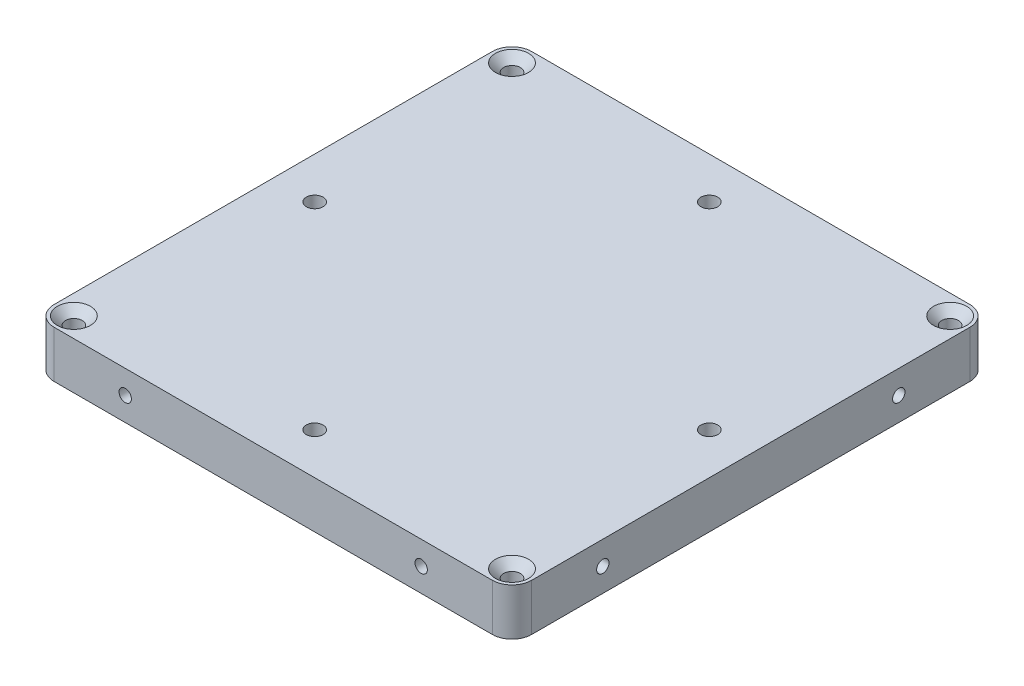
ISO-10303-21;
HEADER;
FILE_DESCRIPTION(('STEP AP214'),'2;1');
FILE_NAME('part.step','',(''),(''),'','','');
FILE_SCHEMA(('AUTOMOTIVE_DESIGN { 1 0 10303 214 1 1 1 1 }'));
ENDSEC;
DATA;
#1=APPLICATION_CONTEXT('core data for automotive mechanical design processes');
#2=APPLICATION_PROTOCOL_DEFINITION('international standard','automotive_design',2000,#1);
#3=PRODUCT_CONTEXT('',#1,'mechanical');
#4=PRODUCT('Part','Part','',(#3));
#5=PRODUCT_RELATED_PRODUCT_CATEGORY('part','',(#4));
#6=PRODUCT_DEFINITION_FORMATION('','',#4);
#7=PRODUCT_DEFINITION_CONTEXT('part definition',#1,'design');
#8=PRODUCT_DEFINITION('design','',#6,#7);
#9=PRODUCT_DEFINITION_SHAPE('','',#8);
#10=(LENGTH_UNIT() NAMED_UNIT(*) SI_UNIT(.MILLI.,.METRE.));
#11=(NAMED_UNIT(*) PLANE_ANGLE_UNIT() SI_UNIT($,.RADIAN.));
#12=(NAMED_UNIT(*) SI_UNIT($,.STERADIAN.) SOLID_ANGLE_UNIT());
#13=UNCERTAINTY_MEASURE_WITH_UNIT(LENGTH_MEASURE(1.E-05),#10,'distance_accuracy_value','');
#14=(GEOMETRIC_REPRESENTATION_CONTEXT(3) GLOBAL_UNCERTAINTY_ASSIGNED_CONTEXT((#13)) GLOBAL_UNIT_ASSIGNED_CONTEXT((#10,
#11,#12)) REPRESENTATION_CONTEXT('',''));
#15=CARTESIAN_POINT('',(0.,0.,0.));
#16=DIRECTION('',(0.,0.,1.));
#17=DIRECTION('',(1.,0.,0.));
#18=AXIS2_PLACEMENT_3D('',#15,#16,#17);
#19=CARTESIAN_POINT('',(-48.4125,4.7625,48.4125));
#20=DIRECTION('',(1.,0.,0.));
#21=DIRECTION('',(0.,0.,-1.));
#22=AXIS2_PLACEMENT_3D('',#19,#20,#21);
#23=PLANE('',#22);
#24=CARTESIAN_POINT('',(-48.4125,0.,-30.));
#25=DIRECTION('',(-1.,0.,0.));
#26=DIRECTION('',(0.,0.,1.));
#27=AXIS2_PLACEMENT_3D('',#24,#25,#26);
#28=CIRCLE('',#27,1.24999999999999);
#29=CARTESIAN_POINT('',(-48.4125,0.,-28.75));
#30=VERTEX_POINT('',#29);
#31=EDGE_CURVE('E164',#30,#30,#28,.T.);
#32=ORIENTED_EDGE('',*,*,#31,.F.);
#33=EDGE_LOOP('',(#32));
#34=FACE_BOUND('',#33,.T.);
#35=CARTESIAN_POINT('',(-48.4125,0.,30.));
#36=DIRECTION('',(-1.,0.,0.));
#37=DIRECTION('',(0.,0.,1.));
#38=AXIS2_PLACEMENT_3D('',#35,#36,#37);
#39=CIRCLE('',#38,1.24999999999999);
#40=CARTESIAN_POINT('',(-48.4125,0.,31.25));
#41=VERTEX_POINT('',#40);
#42=EDGE_CURVE('E170',#41,#41,#39,.T.);
#43=ORIENTED_EDGE('',*,*,#42,.F.);
#44=EDGE_LOOP('',(#43));
#45=FACE_BOUND('',#44,.T.);
#46=DIRECTION('',(0.,0.,1.));
#47=VECTOR('',#46,1.);
#48=CARTESIAN_POINT('',(-48.4125,4.7625,48.4125));
#49=LINE('',#48,#47);
#50=CARTESIAN_POINT('',(-48.4125,4.7625,-44.4125));
#51=VERTEX_POINT('',#50);
#52=CARTESIAN_POINT('',(-48.4125,4.7625,44.4125));
#53=VERTEX_POINT('',#52);
#54=EDGE_CURVE('E252',#51,#53,#49,.T.);
#55=ORIENTED_EDGE('',*,*,#54,.F.);
#56=DIRECTION('',(0.,-1.,0.));
#57=VECTOR('',#56,1.);
#58=CARTESIAN_POINT('',(-48.4125,4.7625,-44.4125));
#59=LINE('',#58,#57);
#60=CARTESIAN_POINT('',(-48.4125,-4.7625,-44.4125));
#61=VERTEX_POINT('',#60);
#62=EDGE_CURVE('E274',#51,#61,#59,.T.);
#63=ORIENTED_EDGE('',*,*,#62,.T.);
#64=DIRECTION('',(0.,0.,1.));
#65=VECTOR('',#64,1.);
#66=CARTESIAN_POINT('',(-48.4125,-4.7625,48.4125));
#67=LINE('',#66,#65);
#68=CARTESIAN_POINT('',(-48.4125,-4.7625,44.4125));
#69=VERTEX_POINT('',#68);
#70=EDGE_CURVE('E251',#61,#69,#67,.T.);
#71=ORIENTED_EDGE('',*,*,#70,.T.);
#72=DIRECTION('',(0.,-1.,0.));
#73=VECTOR('',#72,1.);
#74=CARTESIAN_POINT('',(-48.4125,4.7625,44.4125));
#75=LINE('',#74,#73);
#76=EDGE_CURVE('E263',#69,#53,#75,.F.);
#77=ORIENTED_EDGE('',*,*,#76,.T.);
#78=EDGE_LOOP('',(#55,#63,#71,#77));
#79=FACE_BOUND('',#78,.T.);
#80=ADVANCED_FACE('F41',(#34,#45,#79),#23,.F.);
#81=CARTESIAN_POINT('',(48.4125,4.7625,48.4125));
#82=DIRECTION('',(0.,0.,-1.));
#83=DIRECTION('',(-1.,0.,0.));
#84=AXIS2_PLACEMENT_3D('',#81,#82,#83);
#85=PLANE('',#84);
#86=CARTESIAN_POINT('',(-30.,0.,48.4125));
#87=DIRECTION('',(0.,0.,1.));
#88=DIRECTION('',(1.,0.,0.));
#89=AXIS2_PLACEMENT_3D('',#86,#87,#88);
#90=CIRCLE('',#89,1.24999999999999);
#91=CARTESIAN_POINT('',(-28.75,0.,48.4125));
#92=VERTEX_POINT('',#91);
#93=EDGE_CURVE('E176',#92,#92,#90,.T.);
#94=ORIENTED_EDGE('',*,*,#93,.F.);
#95=EDGE_LOOP('',(#94));
#96=FACE_BOUND('',#95,.T.);
#97=CARTESIAN_POINT('',(30.,0.,48.4125));
#98=DIRECTION('',(0.,0.,1.));
#99=DIRECTION('',(1.,0.,0.));
#100=AXIS2_PLACEMENT_3D('',#97,#98,#99);
#101=CIRCLE('',#100,1.24999999999999);
#102=CARTESIAN_POINT('',(31.25,0.,48.4125));
#103=VERTEX_POINT('',#102);
#104=EDGE_CURVE('E182',#103,#103,#101,.T.);
#105=ORIENTED_EDGE('',*,*,#104,.F.);
#106=EDGE_LOOP('',(#105));
#107=FACE_BOUND('',#106,.T.);
#108=DIRECTION('',(1.,0.,0.));
#109=VECTOR('',#108,1.);
#110=CARTESIAN_POINT('',(48.4125,-4.7625,48.4125));
#111=LINE('',#110,#109);
#112=CARTESIAN_POINT('',(-44.4125,-4.7625,48.4125));
#113=VERTEX_POINT('',#112);
#114=CARTESIAN_POINT('',(44.4125,-4.7625,48.4125));
#115=VERTEX_POINT('',#114);
#116=EDGE_CURVE('E266',#113,#115,#111,.T.);
#117=ORIENTED_EDGE('',*,*,#116,.T.);
#118=DIRECTION('',(0.,-1.,0.));
#119=VECTOR('',#118,1.);
#120=CARTESIAN_POINT('',(44.4125,4.7625,48.4125));
#121=LINE('',#120,#119);
#122=CARTESIAN_POINT('',(44.4125,4.7625,48.4125));
#123=VERTEX_POINT('',#122);
#124=EDGE_CURVE('E11',#115,#123,#121,.F.);
#125=ORIENTED_EDGE('',*,*,#124,.T.);
#126=DIRECTION('',(1.,0.,0.));
#127=VECTOR('',#126,1.);
#128=CARTESIAN_POINT('',(48.4125,4.7625,48.4125));
#129=LINE('',#128,#127);
#130=CARTESIAN_POINT('',(-44.4125,4.7625,48.4125));
#131=VERTEX_POINT('',#130);
#132=EDGE_CURVE('E255',#131,#123,#129,.T.);
#133=ORIENTED_EDGE('',*,*,#132,.F.);
#134=DIRECTION('',(0.,-1.,0.));
#135=VECTOR('',#134,1.);
#136=CARTESIAN_POINT('',(-44.4125,4.7625,48.4125));
#137=LINE('',#136,#135);
#138=EDGE_CURVE('E50',#131,#113,#137,.T.);
#139=ORIENTED_EDGE('',*,*,#138,.T.);
#140=EDGE_LOOP('',(#117,#125,#133,#139));
#141=FACE_BOUND('',#140,.T.);
#142=ADVANCED_FACE('F329',(#96,#107,#141),#85,.F.);
#143=CARTESIAN_POINT('',(48.4125,4.7625,48.4125));
#144=DIRECTION('',(-1.,0.,0.));
#145=DIRECTION('',(0.,0.,1.));
#146=AXIS2_PLACEMENT_3D('',#143,#144,#145);
#147=PLANE('',#146);
#148=CARTESIAN_POINT('',(48.4125,0.,30.));
#149=DIRECTION('',(1.,0.,0.));
#150=DIRECTION('',(0.,0.,-1.));
#151=AXIS2_PLACEMENT_3D('',#148,#149,#150);
#152=CIRCLE('',#151,1.24999999999999);
#153=CARTESIAN_POINT('',(48.4125,0.,28.75));
#154=VERTEX_POINT('',#153);
#155=EDGE_CURVE('E142',#154,#154,#152,.T.);
#156=ORIENTED_EDGE('',*,*,#155,.F.);
#157=EDGE_LOOP('',(#156));
#158=FACE_BOUND('',#157,.T.);
#159=CARTESIAN_POINT('',(48.4125,0.,-30.));
#160=DIRECTION('',(1.,0.,0.));
#161=DIRECTION('',(0.,0.,-1.));
#162=AXIS2_PLACEMENT_3D('',#159,#160,#161);
#163=CIRCLE('',#162,1.24999999999999);
#164=CARTESIAN_POINT('',(48.4125,0.,-31.25));
#165=VERTEX_POINT('',#164);
#166=EDGE_CURVE('E141',#165,#165,#163,.T.);
#167=ORIENTED_EDGE('',*,*,#166,.F.);
#168=EDGE_LOOP('',(#167));
#169=FACE_BOUND('',#168,.T.);
#170=DIRECTION('',(0.,0.,-1.));
#171=VECTOR('',#170,1.);
#172=CARTESIAN_POINT('',(48.4125,-4.7625,48.4125));
#173=LINE('',#172,#171);
#174=CARTESIAN_POINT('',(48.4125,-4.7625,44.4125));
#175=VERTEX_POINT('',#174);
#176=CARTESIAN_POINT('',(48.4125,-4.7625,-44.4125));
#177=VERTEX_POINT('',#176);
#178=EDGE_CURVE('E269',#175,#177,#173,.T.);
#179=ORIENTED_EDGE('',*,*,#178,.T.);
#180=DIRECTION('',(0.,-1.,0.));
#181=VECTOR('',#180,1.);
#182=CARTESIAN_POINT('',(48.4125,4.7625,-44.4125));
#183=LINE('',#182,#181);
#184=CARTESIAN_POINT('',(48.4125,4.7625,-44.4125));
#185=VERTEX_POINT('',#184);
#186=EDGE_CURVE('E58',#177,#185,#183,.F.);
#187=ORIENTED_EDGE('',*,*,#186,.T.);
#188=DIRECTION('',(0.,0.,-1.));
#189=VECTOR('',#188,1.);
#190=CARTESIAN_POINT('',(48.4125,4.7625,48.4125));
#191=LINE('',#190,#189);
#192=CARTESIAN_POINT('',(48.4125,4.7625,44.4125));
#193=VERTEX_POINT('',#192);
#194=EDGE_CURVE('E258',#193,#185,#191,.T.);
#195=ORIENTED_EDGE('',*,*,#194,.F.);
#196=DIRECTION('',(0.,-1.,0.));
#197=VECTOR('',#196,1.);
#198=CARTESIAN_POINT('',(48.4125,4.7625,44.4125));
#199=LINE('',#198,#197);
#200=EDGE_CURVE('E297',#193,#175,#199,.T.);
#201=ORIENTED_EDGE('',*,*,#200,.T.);
#202=EDGE_LOOP('',(#179,#187,#195,#201));
#203=FACE_BOUND('',#202,.T.);
#204=ADVANCED_FACE('F337',(#158,#169,#203),#147,.F.);
#205=CARTESIAN_POINT('',(48.4125,4.7625,-48.4125));
#206=DIRECTION('',(0.,0.,1.));
#207=DIRECTION('',(1.,0.,0.));
#208=AXIS2_PLACEMENT_3D('',#205,#206,#207);
#209=PLANE('',#208);
#210=CARTESIAN_POINT('',(30.,0.,-48.4125));
#211=DIRECTION('',(0.,0.,-1.));
#212=DIRECTION('',(-1.,0.,0.));
#213=AXIS2_PLACEMENT_3D('',#210,#211,#212);
#214=CIRCLE('',#213,1.24999999999999);
#215=CARTESIAN_POINT('',(28.75,0.,-48.4125));
#216=VERTEX_POINT('',#215);
#217=EDGE_CURVE('E152',#216,#216,#214,.T.);
#218=ORIENTED_EDGE('',*,*,#217,.F.);
#219=EDGE_LOOP('',(#218));
#220=FACE_BOUND('',#219,.T.);
#221=CARTESIAN_POINT('',(-30.,0.,-48.4125));
#222=DIRECTION('',(0.,0.,-1.));
#223=DIRECTION('',(-1.,0.,0.));
#224=AXIS2_PLACEMENT_3D('',#221,#222,#223);
#225=CIRCLE('',#224,1.24999999999999);
#226=CARTESIAN_POINT('',(-31.25,0.,-48.4125));
#227=VERTEX_POINT('',#226);
#228=EDGE_CURVE('E158',#227,#227,#225,.T.);
#229=ORIENTED_EDGE('',*,*,#228,.F.);
#230=EDGE_LOOP('',(#229));
#231=FACE_BOUND('',#230,.T.);
#232=DIRECTION('',(-1.,0.,0.));
#233=VECTOR('',#232,1.);
#234=CARTESIAN_POINT('',(48.4125,-4.7625,-48.4125));
#235=LINE('',#234,#233);
#236=CARTESIAN_POINT('',(44.4125,-4.7625,-48.4125));
#237=VERTEX_POINT('',#236);
#238=CARTESIAN_POINT('',(-44.4125,-4.7625,-48.4125));
#239=VERTEX_POINT('',#238);
#240=EDGE_CURVE('E256',#237,#239,#235,.T.);
#241=ORIENTED_EDGE('',*,*,#240,.T.);
#242=DIRECTION('',(0.,-1.,0.));
#243=VECTOR('',#242,1.);
#244=CARTESIAN_POINT('',(-44.4125,4.7625,-48.4125));
#245=LINE('',#244,#243);
#246=CARTESIAN_POINT('',(-44.4125,4.7625,-48.4125));
#247=VERTEX_POINT('',#246);
#248=EDGE_CURVE('E288',#239,#247,#245,.F.);
#249=ORIENTED_EDGE('',*,*,#248,.T.);
#250=DIRECTION('',(-1.,0.,0.));
#251=VECTOR('',#250,1.);
#252=CARTESIAN_POINT('',(48.4125,4.7625,-48.4125));
#253=LINE('',#252,#251);
#254=CARTESIAN_POINT('',(44.4125,4.7625,-48.4125));
#255=VERTEX_POINT('',#254);
#256=EDGE_CURVE('E260',#255,#247,#253,.T.);
#257=ORIENTED_EDGE('',*,*,#256,.F.);
#258=DIRECTION('',(0.,-1.,0.));
#259=VECTOR('',#258,1.);
#260=CARTESIAN_POINT('',(44.4125,4.7625,-48.4125));
#261=LINE('',#260,#259);
#262=EDGE_CURVE('E285',#255,#237,#261,.T.);
#263=ORIENTED_EDGE('',*,*,#262,.T.);
#264=EDGE_LOOP('',(#241,#249,#257,#263));
#265=FACE_BOUND('',#264,.T.);
#266=ADVANCED_FACE('F370',(#220,#231,#265),#209,.F.);
#267=CARTESIAN_POINT('',(0.,4.7625,0.));
#268=DIRECTION('',(0.,1.,0.));
#269=DIRECTION('',(0.,0.,1.));
#270=AXIS2_PLACEMENT_3D('',#267,#268,#269);
#271=PLANE('',#270);
#272=CARTESIAN_POINT('',(-44.4125,4.7625,-44.4125));
#273=DIRECTION('',(0.,1.,0.));
#274=DIRECTION('',(0.,0.,1.));
#275=AXIS2_PLACEMENT_3D('',#272,#273,#274);
#276=CIRCLE('',#275,3.36);
#277=CARTESIAN_POINT('',(-44.4125,4.7625,-41.0525));
#278=VERTEX_POINT('',#277);
#279=EDGE_CURVE('E188',#278,#278,#276,.T.);
#280=ORIENTED_EDGE('',*,*,#279,.F.);
#281=EDGE_LOOP('',(#280));
#282=FACE_BOUND('',#281,.T.);
#283=CARTESIAN_POINT('',(44.4125,4.7625,-44.4125));
#284=DIRECTION('',(0.,1.,0.));
#285=DIRECTION('',(0.,0.,1.));
#286=AXIS2_PLACEMENT_3D('',#283,#284,#285);
#287=CIRCLE('',#286,3.36);
#288=CARTESIAN_POINT('',(44.4125,4.7625,-41.0525));
#289=VERTEX_POINT('',#288);
#290=EDGE_CURVE('E194',#289,#289,#287,.T.);
#291=ORIENTED_EDGE('',*,*,#290,.F.);
#292=EDGE_LOOP('',(#291));
#293=FACE_BOUND('',#292,.T.);
#294=CARTESIAN_POINT('',(44.4125,4.7625,44.4125));
#295=DIRECTION('',(0.,1.,0.));
#296=DIRECTION('',(0.,0.,1.));
#297=AXIS2_PLACEMENT_3D('',#294,#295,#296);
#298=CIRCLE('',#297,3.36);
#299=CARTESIAN_POINT('',(44.4125,4.7625,47.7725));
#300=VERTEX_POINT('',#299);
#301=EDGE_CURVE('E201',#300,#300,#298,.T.);
#302=ORIENTED_EDGE('',*,*,#301,.F.);
#303=EDGE_LOOP('',(#302));
#304=FACE_BOUND('',#303,.T.);
#305=CARTESIAN_POINT('',(-44.4125,4.7625,44.4125));
#306=DIRECTION('',(0.,1.,0.));
#307=DIRECTION('',(0.,0.,1.));
#308=AXIS2_PLACEMENT_3D('',#305,#306,#307);
#309=CIRCLE('',#308,3.36);
#310=CARTESIAN_POINT('',(-44.4125,4.7625,47.7725));
#311=VERTEX_POINT('',#310);
#312=EDGE_CURVE('E208',#311,#311,#309,.T.);
#313=ORIENTED_EDGE('',*,*,#312,.F.);
#314=EDGE_LOOP('',(#313));
#315=FACE_BOUND('',#314,.T.);
#316=CARTESIAN_POINT('',(-40.,4.7625,0.));
#317=DIRECTION('',(0.,-1.,0.));
#318=DIRECTION('',(0.,0.,-1.));
#319=AXIS2_PLACEMENT_3D('',#316,#317,#318);
#320=CIRCLE('',#319,1.7);
#321=CARTESIAN_POINT('',(-40.,4.7625,-1.7));
#322=VERTEX_POINT('',#321);
#323=EDGE_CURVE('E221',#322,#322,#320,.T.);
#324=ORIENTED_EDGE('',*,*,#323,.T.);
#325=EDGE_LOOP('',(#324));
#326=FACE_BOUND('',#325,.T.);
#327=CARTESIAN_POINT('',(0.,4.7625,-40.));
#328=DIRECTION('',(0.,-1.,0.));
#329=DIRECTION('',(0.,0.,-1.));
#330=AXIS2_PLACEMENT_3D('',#327,#328,#329);
#331=CIRCLE('',#330,1.7);
#332=CARTESIAN_POINT('',(0.,4.7625,-41.7));
#333=VERTEX_POINT('',#332);
#334=EDGE_CURVE('E230',#333,#333,#331,.T.);
#335=ORIENTED_EDGE('',*,*,#334,.T.);
#336=EDGE_LOOP('',(#335));
#337=FACE_BOUND('',#336,.T.);
#338=CARTESIAN_POINT('',(40.,4.7625,0.));
#339=DIRECTION('',(0.,-1.,0.));
#340=DIRECTION('',(0.,0.,-1.));
#341=AXIS2_PLACEMENT_3D('',#338,#339,#340);
#342=CIRCLE('',#341,1.7);
#343=CARTESIAN_POINT('',(40.,4.7625,-1.7));
#344=VERTEX_POINT('',#343);
#345=EDGE_CURVE('E239',#344,#344,#342,.T.);
#346=ORIENTED_EDGE('',*,*,#345,.T.);
#347=EDGE_LOOP('',(#346));
#348=FACE_BOUND('',#347,.T.);
#349=CARTESIAN_POINT('',(0.,4.7625,40.));
#350=DIRECTION('',(0.,-1.,0.));
#351=DIRECTION('',(0.,0.,-1.));
#352=AXIS2_PLACEMENT_3D('',#349,#350,#351);
#353=CIRCLE('',#352,1.7);
#354=CARTESIAN_POINT('',(0.,4.7625,38.3));
#355=VERTEX_POINT('',#354);
#356=EDGE_CURVE('E248',#355,#355,#353,.T.);
#357=ORIENTED_EDGE('',*,*,#356,.T.);
#358=EDGE_LOOP('',(#357));
#359=FACE_BOUND('',#358,.T.);
#360=ORIENTED_EDGE('',*,*,#256,.T.);
#361=CARTESIAN_POINT('',(-44.4125,4.7625,-44.4125));
#362=DIRECTION('',(0.,1.,0.));
#363=DIRECTION('',(0.,0.,1.));
#364=AXIS2_PLACEMENT_3D('',#361,#362,#363);
#365=CIRCLE('',#364,4.);
#366=EDGE_CURVE('E295',#247,#51,#365,.T.);
#367=ORIENTED_EDGE('',*,*,#366,.T.);
#368=ORIENTED_EDGE('',*,*,#54,.T.);
#369=CARTESIAN_POINT('',(-44.4125,4.7625,44.4125));
#370=DIRECTION('',(0.,1.,0.));
#371=DIRECTION('',(0.,0.,1.));
#372=AXIS2_PLACEMENT_3D('',#369,#370,#371);
#373=CIRCLE('',#372,4.);
#374=EDGE_CURVE('E290',#53,#131,#373,.T.);
#375=ORIENTED_EDGE('',*,*,#374,.T.);
#376=ORIENTED_EDGE('',*,*,#132,.T.);
#377=CARTESIAN_POINT('',(44.4125,4.7625,44.4125));
#378=DIRECTION('',(0.,1.,0.));
#379=DIRECTION('',(0.,0.,1.));
#380=AXIS2_PLACEMENT_3D('',#377,#378,#379);
#381=CIRCLE('',#380,4.);
#382=EDGE_CURVE('E65',#123,#193,#381,.T.);
#383=ORIENTED_EDGE('',*,*,#382,.T.);
#384=ORIENTED_EDGE('',*,*,#194,.T.);
#385=CARTESIAN_POINT('',(44.4125,4.7625,-44.4125));
#386=DIRECTION('',(0.,1.,0.));
#387=DIRECTION('',(0.,0.,1.));
#388=AXIS2_PLACEMENT_3D('',#385,#386,#387);
#389=CIRCLE('',#388,4.);
#390=EDGE_CURVE('E293',#185,#255,#389,.T.);
#391=ORIENTED_EDGE('',*,*,#390,.T.);
#392=EDGE_LOOP('',(#360,#367,#368,#375,#376,#383,#384,#391));
#393=FACE_BOUND('',#392,.T.);
#394=ADVANCED_FACE('F373',(#282,#293,#304,#315,#326,#337,#348,#359,#393),#271,.T.);
#395=CARTESIAN_POINT('',(0.,-4.7625,0.));
#396=DIRECTION('',(0.,1.,0.));
#397=DIRECTION('',(0.,0.,1.));
#398=AXIS2_PLACEMENT_3D('',#395,#396,#397);
#399=PLANE('',#398);
#400=CARTESIAN_POINT('',(-44.4125,-4.7625,-44.4125));
#401=DIRECTION('',(0.,1.,0.));
#402=DIRECTION('',(0.,0.,1.));
#403=AXIS2_PLACEMENT_3D('',#400,#401,#402);
#404=CIRCLE('',#403,1.69999999999999);
#405=CARTESIAN_POINT('',(-44.4125,-4.7625,-42.7125));
#406=VERTEX_POINT('',#405);
#407=EDGE_CURVE('E45',#406,#406,#404,.T.);
#408=ORIENTED_EDGE('',*,*,#407,.T.);
#409=EDGE_LOOP('',(#408));
#410=FACE_BOUND('',#409,.T.);
#411=CARTESIAN_POINT('',(44.4125,-4.7625,-44.4125));
#412=DIRECTION('',(0.,1.,0.));
#413=DIRECTION('',(0.,0.,1.));
#414=AXIS2_PLACEMENT_3D('',#411,#412,#413);
#415=CIRCLE('',#414,1.69999999999999);
#416=CARTESIAN_POINT('',(44.4125,-4.7625,-42.7125));
#417=VERTEX_POINT('',#416);
#418=EDGE_CURVE('E200',#417,#417,#415,.T.);
#419=ORIENTED_EDGE('',*,*,#418,.T.);
#420=EDGE_LOOP('',(#419));
#421=FACE_BOUND('',#420,.T.);
#422=CARTESIAN_POINT('',(44.4125,-4.7625,44.4125));
#423=DIRECTION('',(0.,1.,0.));
#424=DIRECTION('',(0.,0.,1.));
#425=AXIS2_PLACEMENT_3D('',#422,#423,#424);
#426=CIRCLE('',#425,1.69999999999999);
#427=CARTESIAN_POINT('',(44.4125,-4.7625,46.1125));
#428=VERTEX_POINT('',#427);
#429=EDGE_CURVE('E207',#428,#428,#426,.T.);
#430=ORIENTED_EDGE('',*,*,#429,.T.);
#431=EDGE_LOOP('',(#430));
#432=FACE_BOUND('',#431,.T.);
#433=CARTESIAN_POINT('',(-44.4125,-4.7625,44.4125));
#434=DIRECTION('',(0.,1.,0.));
#435=DIRECTION('',(0.,0.,1.));
#436=AXIS2_PLACEMENT_3D('',#433,#434,#435);
#437=CIRCLE('',#436,1.69999999999999);
#438=CARTESIAN_POINT('',(-44.4125,-4.7625,46.1125));
#439=VERTEX_POINT('',#438);
#440=EDGE_CURVE('E214',#439,#439,#437,.T.);
#441=ORIENTED_EDGE('',*,*,#440,.T.);
#442=EDGE_LOOP('',(#441));
#443=FACE_BOUND('',#442,.T.);
#444=CARTESIAN_POINT('',(-40.,-4.7625,0.));
#445=DIRECTION('',(0.,-1.,0.));
#446=DIRECTION('',(0.,0.,-1.));
#447=AXIS2_PLACEMENT_3D('',#444,#445,#446);
#448=CIRCLE('',#447,3.36);
#449=CARTESIAN_POINT('',(-40.,-4.7625,-3.36));
#450=VERTEX_POINT('',#449);
#451=EDGE_CURVE('E215',#450,#450,#448,.T.);
#452=ORIENTED_EDGE('',*,*,#451,.F.);
#453=EDGE_LOOP('',(#452));
#454=FACE_BOUND('',#453,.T.);
#455=CARTESIAN_POINT('',(0.,-4.7625,-40.));
#456=DIRECTION('',(0.,-1.,0.));
#457=DIRECTION('',(0.,0.,-1.));
#458=AXIS2_PLACEMENT_3D('',#455,#456,#457);
#459=CIRCLE('',#458,3.36);
#460=CARTESIAN_POINT('',(0.,-4.7625,-43.36));
#461=VERTEX_POINT('',#460);
#462=EDGE_CURVE('E224',#461,#461,#459,.T.);
#463=ORIENTED_EDGE('',*,*,#462,.F.);
#464=EDGE_LOOP('',(#463));
#465=FACE_BOUND('',#464,.T.);
#466=CARTESIAN_POINT('',(40.,-4.7625,0.));
#467=DIRECTION('',(0.,-1.,0.));
#468=DIRECTION('',(0.,0.,-1.));
#469=AXIS2_PLACEMENT_3D('',#466,#467,#468);
#470=CIRCLE('',#469,3.36);
#471=CARTESIAN_POINT('',(40.,-4.7625,-3.36));
#472=VERTEX_POINT('',#471);
#473=EDGE_CURVE('E233',#472,#472,#470,.T.);
#474=ORIENTED_EDGE('',*,*,#473,.F.);
#475=EDGE_LOOP('',(#474));
#476=FACE_BOUND('',#475,.T.);
#477=CARTESIAN_POINT('',(0.,-4.7625,40.));
#478=DIRECTION('',(0.,-1.,0.));
#479=DIRECTION('',(0.,0.,-1.));
#480=AXIS2_PLACEMENT_3D('',#477,#478,#479);
#481=CIRCLE('',#480,3.36);
#482=CARTESIAN_POINT('',(0.,-4.7625,36.64));
#483=VERTEX_POINT('',#482);
#484=EDGE_CURVE('E242',#483,#483,#481,.T.);
#485=ORIENTED_EDGE('',*,*,#484,.F.);
#486=EDGE_LOOP('',(#485));
#487=FACE_BOUND('',#486,.T.);
#488=ORIENTED_EDGE('',*,*,#70,.F.);
#489=CARTESIAN_POINT('',(-44.4125,-4.7625,-44.4125));
#490=DIRECTION('',(0.,1.,0.));
#491=DIRECTION('',(0.,0.,1.));
#492=AXIS2_PLACEMENT_3D('',#489,#490,#491);
#493=CIRCLE('',#492,4.);
#494=EDGE_CURVE('E283',#61,#239,#493,.F.);
#495=ORIENTED_EDGE('',*,*,#494,.T.);
#496=ORIENTED_EDGE('',*,*,#240,.F.);
#497=CARTESIAN_POINT('',(44.4125,-4.7625,-44.4125));
#498=DIRECTION('',(0.,1.,0.));
#499=DIRECTION('',(0.,0.,1.));
#500=AXIS2_PLACEMENT_3D('',#497,#498,#499);
#501=CIRCLE('',#500,4.);
#502=EDGE_CURVE('E281',#237,#177,#501,.F.);
#503=ORIENTED_EDGE('',*,*,#502,.T.);
#504=ORIENTED_EDGE('',*,*,#178,.F.);
#505=CARTESIAN_POINT('',(44.4125,-4.7625,44.4125));
#506=DIRECTION('',(0.,1.,0.));
#507=DIRECTION('',(0.,0.,1.));
#508=AXIS2_PLACEMENT_3D('',#505,#506,#507);
#509=CIRCLE('',#508,4.);
#510=EDGE_CURVE('E279',#175,#115,#509,.F.);
#511=ORIENTED_EDGE('',*,*,#510,.T.);
#512=ORIENTED_EDGE('',*,*,#116,.F.);
#513=CARTESIAN_POINT('',(-44.4125,-4.7625,44.4125));
#514=DIRECTION('',(0.,1.,0.));
#515=DIRECTION('',(0.,0.,1.));
#516=AXIS2_PLACEMENT_3D('',#513,#514,#515);
#517=CIRCLE('',#516,4.);
#518=EDGE_CURVE('E277',#113,#69,#517,.F.);
#519=ORIENTED_EDGE('',*,*,#518,.T.);
#520=EDGE_LOOP('',(#488,#495,#496,#503,#504,#511,#512,#519));
#521=FACE_BOUND('',#520,.T.);
#522=ADVANCED_FACE('F309',(#410,#421,#432,#443,#454,#465,#476,#487,#521),#399,.F.);
#523=CARTESIAN_POINT('',(-44.4125,4.7625,-44.4125));
#524=DIRECTION('',(0.,-1.,0.));
#525=DIRECTION('',(0.,0.,-1.));
#526=AXIS2_PLACEMENT_3D('',#523,#524,#525);
#527=CYLINDRICAL_SURFACE('',#526,4.);
#528=ORIENTED_EDGE('',*,*,#366,.F.);
#529=ORIENTED_EDGE('',*,*,#248,.F.);
#530=ORIENTED_EDGE('',*,*,#494,.F.);
#531=ORIENTED_EDGE('',*,*,#62,.F.);
#532=EDGE_LOOP('',(#528,#529,#530,#531));
#533=FACE_BOUND('',#532,.T.);
#534=ADVANCED_FACE('F344',(#533),#527,.T.);
#535=CARTESIAN_POINT('',(44.4125,4.7625,-44.4125));
#536=DIRECTION('',(0.,-1.,0.));
#537=DIRECTION('',(0.,0.,-1.));
#538=AXIS2_PLACEMENT_3D('',#535,#536,#537);
#539=CYLINDRICAL_SURFACE('',#538,4.);
#540=ORIENTED_EDGE('',*,*,#390,.F.);
#541=ORIENTED_EDGE('',*,*,#186,.F.);
#542=ORIENTED_EDGE('',*,*,#502,.F.);
#543=ORIENTED_EDGE('',*,*,#262,.F.);
#544=EDGE_LOOP('',(#540,#541,#542,#543));
#545=FACE_BOUND('',#544,.T.);
#546=ADVANCED_FACE('F347',(#545),#539,.T.);
#547=CARTESIAN_POINT('',(44.4125,4.7625,44.4125));
#548=DIRECTION('',(0.,-1.,0.));
#549=DIRECTION('',(0.,0.,-1.));
#550=AXIS2_PLACEMENT_3D('',#547,#548,#549);
#551=CYLINDRICAL_SURFACE('',#550,4.);
#552=ORIENTED_EDGE('',*,*,#382,.F.);
#553=ORIENTED_EDGE('',*,*,#124,.F.);
#554=ORIENTED_EDGE('',*,*,#510,.F.);
#555=ORIENTED_EDGE('',*,*,#200,.F.);
#556=EDGE_LOOP('',(#552,#553,#554,#555));
#557=FACE_BOUND('',#556,.T.);
#558=ADVANCED_FACE('F350',(#557),#551,.T.);
#559=CARTESIAN_POINT('',(-44.4125,4.7625,44.4125));
#560=DIRECTION('',(0.,-1.,0.));
#561=DIRECTION('',(0.,0.,-1.));
#562=AXIS2_PLACEMENT_3D('',#559,#560,#561);
#563=CYLINDRICAL_SURFACE('',#562,4.);
#564=ORIENTED_EDGE('',*,*,#374,.F.);
#565=ORIENTED_EDGE('',*,*,#76,.F.);
#566=ORIENTED_EDGE('',*,*,#518,.F.);
#567=ORIENTED_EDGE('',*,*,#138,.F.);
#568=EDGE_LOOP('',(#564,#565,#566,#567));
#569=FACE_BOUND('',#568,.T.);
#570=ADVANCED_FACE('F43',(#569),#563,.T.);
#571=CARTESIAN_POINT('',(0.,-4.7625,40.));
#572=DIRECTION('',(0.,-1.,0.));
#573=DIRECTION('',(0.,0.,-1.));
#574=AXIS2_PLACEMENT_3D('',#571,#572,#573);
#575=CYLINDRICAL_SURFACE('',#574,1.7);
#576=ORIENTED_EDGE('',*,*,#356,.F.);
#577=EDGE_LOOP('',(#576));
#578=FACE_BOUND('',#577,.T.);
#579=CARTESIAN_POINT('',(0.,-3.1025,40.));
#580=DIRECTION('',(0.,-1.,0.));
#581=DIRECTION('',(0.,0.,-1.));
#582=AXIS2_PLACEMENT_3D('',#579,#580,#581);
#583=CIRCLE('',#582,1.7);
#584=CARTESIAN_POINT('',(0.,-3.1025,38.3));
#585=VERTEX_POINT('',#584);
#586=EDGE_CURVE('E245',#585,#585,#583,.T.);
#587=ORIENTED_EDGE('',*,*,#586,.T.);
#588=EDGE_LOOP('',(#587));
#589=FACE_BOUND('',#588,.T.);
#590=ADVANCED_FACE('F357',(#578,#589),#575,.F.);
#591=CARTESIAN_POINT('',(0.,-4.7625,40.));
#592=DIRECTION('',(0.,-1.,0.));
#593=DIRECTION('',(0.,0.,-1.));
#594=AXIS2_PLACEMENT_3D('',#591,#592,#593);
#595=CONICAL_SURFACE('',#594,3.36,0.785398163397449);
#596=ORIENTED_EDGE('',*,*,#586,.F.);
#597=EDGE_LOOP('',(#596));
#598=FACE_BOUND('',#597,.T.);
#599=ORIENTED_EDGE('',*,*,#484,.T.);
#600=EDGE_LOOP('',(#599));
#601=FACE_BOUND('',#600,.T.);
#602=ADVANCED_FACE('F633',(#598,#601),#595,.F.);
#603=CARTESIAN_POINT('',(40.,-4.7625,0.));
#604=DIRECTION('',(0.,-1.,0.));
#605=DIRECTION('',(0.,0.,-1.));
#606=AXIS2_PLACEMENT_3D('',#603,#604,#605);
#607=CYLINDRICAL_SURFACE('',#606,1.7);
#608=ORIENTED_EDGE('',*,*,#345,.F.);
#609=EDGE_LOOP('',(#608));
#610=FACE_BOUND('',#609,.T.);
#611=CARTESIAN_POINT('',(40.,-3.1025,0.));
#612=DIRECTION('',(0.,-1.,0.));
#613=DIRECTION('',(0.,0.,-1.));
#614=AXIS2_PLACEMENT_3D('',#611,#612,#613);
#615=CIRCLE('',#614,1.7);
#616=CARTESIAN_POINT('',(40.,-3.1025,-1.7));
#617=VERTEX_POINT('',#616);
#618=EDGE_CURVE('E236',#617,#617,#615,.T.);
#619=ORIENTED_EDGE('',*,*,#618,.T.);
#620=EDGE_LOOP('',(#619));
#621=FACE_BOUND('',#620,.T.);
#622=ADVANCED_FACE('F642',(#610,#621),#607,.F.);
#623=CARTESIAN_POINT('',(40.,-4.7625,0.));
#624=DIRECTION('',(0.,-1.,0.));
#625=DIRECTION('',(0.,0.,-1.));
#626=AXIS2_PLACEMENT_3D('',#623,#624,#625);
#627=CONICAL_SURFACE('',#626,3.36,0.785398163397449);
#628=ORIENTED_EDGE('',*,*,#618,.F.);
#629=EDGE_LOOP('',(#628));
#630=FACE_BOUND('',#629,.T.);
#631=ORIENTED_EDGE('',*,*,#473,.T.);
#632=EDGE_LOOP('',(#631));
#633=FACE_BOUND('',#632,.T.);
#634=ADVANCED_FACE('F651',(#630,#633),#627,.F.);
#635=CARTESIAN_POINT('',(0.,-4.7625,-40.));
#636=DIRECTION('',(0.,-1.,0.));
#637=DIRECTION('',(0.,0.,-1.));
#638=AXIS2_PLACEMENT_3D('',#635,#636,#637);
#639=CYLINDRICAL_SURFACE('',#638,1.7);
#640=ORIENTED_EDGE('',*,*,#334,.F.);
#641=EDGE_LOOP('',(#640));
#642=FACE_BOUND('',#641,.T.);
#643=CARTESIAN_POINT('',(0.,-3.1025,-40.));
#644=DIRECTION('',(0.,-1.,0.));
#645=DIRECTION('',(0.,0.,-1.));
#646=AXIS2_PLACEMENT_3D('',#643,#644,#645);
#647=CIRCLE('',#646,1.7);
#648=CARTESIAN_POINT('',(0.,-3.1025,-41.7));
#649=VERTEX_POINT('',#648);
#650=EDGE_CURVE('E227',#649,#649,#647,.T.);
#651=ORIENTED_EDGE('',*,*,#650,.T.);
#652=EDGE_LOOP('',(#651));
#653=FACE_BOUND('',#652,.T.);
#654=ADVANCED_FACE('F661',(#642,#653),#639,.F.);
#655=CARTESIAN_POINT('',(0.,-4.7625,-40.));
#656=DIRECTION('',(0.,-1.,0.));
#657=DIRECTION('',(0.,0.,-1.));
#658=AXIS2_PLACEMENT_3D('',#655,#656,#657);
#659=CONICAL_SURFACE('',#658,3.36,0.785398163397449);
#660=ORIENTED_EDGE('',*,*,#650,.F.);
#661=EDGE_LOOP('',(#660));
#662=FACE_BOUND('',#661,.T.);
#663=ORIENTED_EDGE('',*,*,#462,.T.);
#664=EDGE_LOOP('',(#663));
#665=FACE_BOUND('',#664,.T.);
#666=ADVANCED_FACE('F671',(#662,#665),#659,.F.);
#667=CARTESIAN_POINT('',(-40.,-4.7625,0.));
#668=DIRECTION('',(0.,-1.,0.));
#669=DIRECTION('',(0.,0.,-1.));
#670=AXIS2_PLACEMENT_3D('',#667,#668,#669);
#671=CYLINDRICAL_SURFACE('',#670,1.7);
#672=ORIENTED_EDGE('',*,*,#323,.F.);
#673=EDGE_LOOP('',(#672));
#674=FACE_BOUND('',#673,.T.);
#675=CARTESIAN_POINT('',(-40.,-3.1025,0.));
#676=DIRECTION('',(0.,-1.,0.));
#677=DIRECTION('',(0.,0.,-1.));
#678=AXIS2_PLACEMENT_3D('',#675,#676,#677);
#679=CIRCLE('',#678,1.7);
#680=CARTESIAN_POINT('',(-40.,-3.1025,-1.7));
#681=VERTEX_POINT('',#680);
#682=EDGE_CURVE('E218',#681,#681,#679,.T.);
#683=ORIENTED_EDGE('',*,*,#682,.T.);
#684=EDGE_LOOP('',(#683));
#685=FACE_BOUND('',#684,.T.);
#686=ADVANCED_FACE('F681',(#674,#685),#671,.F.);
#687=CARTESIAN_POINT('',(-40.,-4.7625,0.));
#688=DIRECTION('',(0.,-1.,0.));
#689=DIRECTION('',(0.,0.,-1.));
#690=AXIS2_PLACEMENT_3D('',#687,#688,#689);
#691=CONICAL_SURFACE('',#690,3.36,0.785398163397449);
#692=ORIENTED_EDGE('',*,*,#682,.F.);
#693=EDGE_LOOP('',(#692));
#694=FACE_BOUND('',#693,.T.);
#695=ORIENTED_EDGE('',*,*,#451,.T.);
#696=EDGE_LOOP('',(#695));
#697=FACE_BOUND('',#696,.T.);
#698=ADVANCED_FACE('F691',(#694,#697),#691,.F.);
#699=CARTESIAN_POINT('',(-44.4125,4.7625,44.4125));
#700=DIRECTION('',(0.,1.,0.));
#701=DIRECTION('',(0.,0.,1.));
#702=AXIS2_PLACEMENT_3D('',#699,#700,#701);
#703=CYLINDRICAL_SURFACE('',#702,1.69999999999999);
#704=CARTESIAN_POINT('',(-44.4125,3.10249999999999,44.4125));
#705=DIRECTION('',(0.,1.,0.));
#706=DIRECTION('',(0.,0.,1.));
#707=AXIS2_PLACEMENT_3D('',#704,#705,#706);
#708=CIRCLE('',#707,1.69999999999999);
#709=CARTESIAN_POINT('',(-44.4125,3.10249999999999,46.1125));
#710=VERTEX_POINT('',#709);
#711=EDGE_CURVE('E211',#710,#710,#708,.T.);
#712=ORIENTED_EDGE('',*,*,#711,.T.);
#713=EDGE_LOOP('',(#712));
#714=FACE_BOUND('',#713,.T.);
#715=ORIENTED_EDGE('',*,*,#440,.F.);
#716=EDGE_LOOP('',(#715));
#717=FACE_BOUND('',#716,.T.);
#718=ADVANCED_FACE('F700',(#714,#717),#703,.F.);
#719=CARTESIAN_POINT('',(-44.4125,4.7625,44.4125));
#720=DIRECTION('',(0.,1.,0.));
#721=DIRECTION('',(0.,0.,1.));
#722=AXIS2_PLACEMENT_3D('',#719,#720,#721);
#723=CONICAL_SURFACE('',#722,3.36,0.785398163397448);
#724=ORIENTED_EDGE('',*,*,#711,.F.);
#725=EDGE_LOOP('',(#724));
#726=FACE_BOUND('',#725,.T.);
#727=ORIENTED_EDGE('',*,*,#312,.T.);
#728=EDGE_LOOP('',(#727));
#729=FACE_BOUND('',#728,.T.);
#730=ADVANCED_FACE('F709',(#726,#729),#723,.F.);
#731=CARTESIAN_POINT('',(44.4125,4.7625,44.4125));
#732=DIRECTION('',(0.,1.,0.));
#733=DIRECTION('',(0.,0.,1.));
#734=AXIS2_PLACEMENT_3D('',#731,#732,#733);
#735=CYLINDRICAL_SURFACE('',#734,1.69999999999999);
#736=CARTESIAN_POINT('',(44.4125,3.10249999999999,44.4125));
#737=DIRECTION('',(0.,1.,0.));
#738=DIRECTION('',(0.,0.,1.));
#739=AXIS2_PLACEMENT_3D('',#736,#737,#738);
#740=CIRCLE('',#739,1.69999999999999);
#741=CARTESIAN_POINT('',(44.4125,3.10249999999999,46.1125));
#742=VERTEX_POINT('',#741);
#743=EDGE_CURVE('E204',#742,#742,#740,.T.);
#744=ORIENTED_EDGE('',*,*,#743,.T.);
#745=EDGE_LOOP('',(#744));
#746=FACE_BOUND('',#745,.T.);
#747=ORIENTED_EDGE('',*,*,#429,.F.);
#748=EDGE_LOOP('',(#747));
#749=FACE_BOUND('',#748,.T.);
#750=ADVANCED_FACE('F325',(#746,#749),#735,.F.);
#751=CARTESIAN_POINT('',(44.4125,4.7625,44.4125));
#752=DIRECTION('',(0.,1.,0.));
#753=DIRECTION('',(0.,0.,1.));
#754=AXIS2_PLACEMENT_3D('',#751,#752,#753);
#755=CONICAL_SURFACE('',#754,3.36,0.785398163397448);
#756=ORIENTED_EDGE('',*,*,#743,.F.);
#757=EDGE_LOOP('',(#756));
#758=FACE_BOUND('',#757,.T.);
#759=ORIENTED_EDGE('',*,*,#301,.T.);
#760=EDGE_LOOP('',(#759));
#761=FACE_BOUND('',#760,.T.);
#762=ADVANCED_FACE('F315',(#758,#761),#755,.F.);
#763=CARTESIAN_POINT('',(44.4125,4.7625,-44.4125));
#764=DIRECTION('',(0.,1.,0.));
#765=DIRECTION('',(0.,0.,1.));
#766=AXIS2_PLACEMENT_3D('',#763,#764,#765);
#767=CYLINDRICAL_SURFACE('',#766,1.69999999999999);
#768=CARTESIAN_POINT('',(44.4125,3.10249999999999,-44.4125));
#769=DIRECTION('',(0.,1.,0.));
#770=DIRECTION('',(0.,0.,1.));
#771=AXIS2_PLACEMENT_3D('',#768,#769,#770);
#772=CIRCLE('',#771,1.69999999999999);
#773=CARTESIAN_POINT('',(44.4125,3.10249999999999,-42.7125));
#774=VERTEX_POINT('',#773);
#775=EDGE_CURVE('E197',#774,#774,#772,.T.);
#776=ORIENTED_EDGE('',*,*,#775,.T.);
#777=EDGE_LOOP('',(#776));
#778=FACE_BOUND('',#777,.T.);
#779=ORIENTED_EDGE('',*,*,#418,.F.);
#780=EDGE_LOOP('',(#779));
#781=FACE_BOUND('',#780,.T.);
#782=ADVANCED_FACE('F312',(#778,#781),#767,.F.);
#783=CARTESIAN_POINT('',(44.4125,4.7625,-44.4125));
#784=DIRECTION('',(0.,1.,0.));
#785=DIRECTION('',(0.,0.,1.));
#786=AXIS2_PLACEMENT_3D('',#783,#784,#785);
#787=CONICAL_SURFACE('',#786,3.36,0.785398163397448);
#788=ORIENTED_EDGE('',*,*,#775,.F.);
#789=EDGE_LOOP('',(#788));
#790=FACE_BOUND('',#789,.T.);
#791=ORIENTED_EDGE('',*,*,#290,.T.);
#792=EDGE_LOOP('',(#791));
#793=FACE_BOUND('',#792,.T.);
#794=ADVANCED_FACE('F314',(#790,#793),#787,.F.);
#795=CARTESIAN_POINT('',(-44.4125,4.7625,-44.4125));
#796=DIRECTION('',(0.,1.,0.));
#797=DIRECTION('',(0.,0.,1.));
#798=AXIS2_PLACEMENT_3D('',#795,#796,#797);
#799=CYLINDRICAL_SURFACE('',#798,1.69999999999999);
#800=CARTESIAN_POINT('',(-44.4125,3.10249999999999,-44.4125));
#801=DIRECTION('',(0.,1.,0.));
#802=DIRECTION('',(0.,0.,1.));
#803=AXIS2_PLACEMENT_3D('',#800,#801,#802);
#804=CIRCLE('',#803,1.69999999999999);
#805=CARTESIAN_POINT('',(-44.4125,3.10249999999999,-42.7125));
#806=VERTEX_POINT('',#805);
#807=EDGE_CURVE('E191',#806,#806,#804,.T.);
#808=ORIENTED_EDGE('',*,*,#807,.T.);
#809=EDGE_LOOP('',(#808));
#810=FACE_BOUND('',#809,.T.);
#811=ORIENTED_EDGE('',*,*,#407,.F.);
#812=EDGE_LOOP('',(#811));
#813=FACE_BOUND('',#812,.T.);
#814=ADVANCED_FACE('F322',(#810,#813),#799,.F.);
#815=CARTESIAN_POINT('',(-44.4125,4.7625,-44.4125));
#816=DIRECTION('',(0.,1.,0.));
#817=DIRECTION('',(0.,0.,1.));
#818=AXIS2_PLACEMENT_3D('',#815,#816,#817);
#819=CONICAL_SURFACE('',#818,3.36,0.785398163397448);
#820=ORIENTED_EDGE('',*,*,#807,.F.);
#821=EDGE_LOOP('',(#820));
#822=FACE_BOUND('',#821,.T.);
#823=ORIENTED_EDGE('',*,*,#279,.T.);
#824=EDGE_LOOP('',(#823));
#825=FACE_BOUND('',#824,.T.);
#826=ADVANCED_FACE('F463',(#822,#825),#819,.F.);
#827=CARTESIAN_POINT('',(30.,0.,38.4125));
#828=DIRECTION('',(0.,0.,1.));
#829=DIRECTION('',(1.,0.,0.));
#830=AXIS2_PLACEMENT_3D('',#827,#828,#829);
#831=CONICAL_SURFACE('',#830,1.25,1.02974425867665);
#832=CARTESIAN_POINT('',(30.,0.,37.6614242262156));
#833=VERTEX_POINT('',#832);
#834=VERTEX_LOOP('',#833);
#835=FACE_BOUND('',#834,.T.);
#836=CARTESIAN_POINT('',(30.,0.,38.4125));
#837=DIRECTION('',(0.,0.,1.));
#838=DIRECTION('',(1.,0.,0.));
#839=AXIS2_PLACEMENT_3D('',#836,#837,#838);
#840=CIRCLE('',#839,1.25);
#841=CARTESIAN_POINT('',(31.25,0.,38.4125));
#842=VERTEX_POINT('',#841);
#843=EDGE_CURVE('E185',#842,#842,#840,.T.);
#844=ORIENTED_EDGE('',*,*,#843,.T.);
#845=EDGE_LOOP('',(#844));
#846=FACE_BOUND('',#845,.T.);
#847=ADVANCED_FACE('F459',(#835,#846),#831,.F.);
#848=CARTESIAN_POINT('',(30.,0.,48.4125));
#849=DIRECTION('',(0.,0.,1.));
#850=DIRECTION('',(1.,0.,0.));
#851=AXIS2_PLACEMENT_3D('',#848,#849,#850);
#852=CYLINDRICAL_SURFACE('',#851,1.24999999999999);
#853=ORIENTED_EDGE('',*,*,#843,.F.);
#854=EDGE_LOOP('',(#853));
#855=FACE_BOUND('',#854,.T.);
#856=ORIENTED_EDGE('',*,*,#104,.T.);
#857=EDGE_LOOP('',(#856));
#858=FACE_BOUND('',#857,.T.);
#859=ADVANCED_FACE('F455',(#855,#858),#852,.F.);
#860=CARTESIAN_POINT('',(-30.,0.,38.4125));
#861=DIRECTION('',(0.,0.,1.));
#862=DIRECTION('',(1.,0.,0.));
#863=AXIS2_PLACEMENT_3D('',#860,#861,#862);
#864=CONICAL_SURFACE('',#863,1.25,1.02974425867665);
#865=CARTESIAN_POINT('',(-30.,0.,37.6614242262156));
#866=VERTEX_POINT('',#865);
#867=VERTEX_LOOP('',#866);
#868=FACE_BOUND('',#867,.T.);
#869=CARTESIAN_POINT('',(-30.,0.,38.4125));
#870=DIRECTION('',(0.,0.,1.));
#871=DIRECTION('',(1.,0.,0.));
#872=AXIS2_PLACEMENT_3D('',#869,#870,#871);
#873=CIRCLE('',#872,1.25);
#874=CARTESIAN_POINT('',(-28.75,0.,38.4125));
#875=VERTEX_POINT('',#874);
#876=EDGE_CURVE('E179',#875,#875,#873,.T.);
#877=ORIENTED_EDGE('',*,*,#876,.T.);
#878=EDGE_LOOP('',(#877));
#879=FACE_BOUND('',#878,.T.);
#880=ADVANCED_FACE('F451',(#868,#879),#864,.F.);
#881=CARTESIAN_POINT('',(-30.,0.,48.4125));
#882=DIRECTION('',(0.,0.,1.));
#883=DIRECTION('',(1.,0.,0.));
#884=AXIS2_PLACEMENT_3D('',#881,#882,#883);
#885=CYLINDRICAL_SURFACE('',#884,1.24999999999999);
#886=ORIENTED_EDGE('',*,*,#876,.F.);
#887=EDGE_LOOP('',(#886));
#888=FACE_BOUND('',#887,.T.);
#889=ORIENTED_EDGE('',*,*,#93,.T.);
#890=EDGE_LOOP('',(#889));
#891=FACE_BOUND('',#890,.T.);
#892=ADVANCED_FACE('F448',(#888,#891),#885,.F.);
#893=CARTESIAN_POINT('',(-38.4125,0.,30.));
#894=DIRECTION('',(-1.,0.,0.));
#895=DIRECTION('',(0.,0.,1.));
#896=AXIS2_PLACEMENT_3D('',#893,#894,#895);
#897=CONICAL_SURFACE('',#896,1.25,1.02974425867665);
#898=CARTESIAN_POINT('',(-37.6614242262155,0.,30.));
#899=VERTEX_POINT('',#898);
#900=VERTEX_LOOP('',#899);
#901=FACE_BOUND('',#900,.T.);
#902=CARTESIAN_POINT('',(-38.4125,0.,30.));
#903=DIRECTION('',(-1.,0.,0.));
#904=DIRECTION('',(0.,0.,1.));
#905=AXIS2_PLACEMENT_3D('',#902,#903,#904);
#906=CIRCLE('',#905,1.25);
#907=CARTESIAN_POINT('',(-38.4125,0.,31.25));
#908=VERTEX_POINT('',#907);
#909=EDGE_CURVE('E173',#908,#908,#906,.T.);
#910=ORIENTED_EDGE('',*,*,#909,.T.);
#911=EDGE_LOOP('',(#910));
#912=FACE_BOUND('',#911,.T.);
#913=ADVANCED_FACE('F445',(#901,#912),#897,.F.);
#914=CARTESIAN_POINT('',(-48.4125,0.,30.));
#915=DIRECTION('',(-1.,0.,0.));
#916=DIRECTION('',(0.,0.,1.));
#917=AXIS2_PLACEMENT_3D('',#914,#915,#916);
#918=CYLINDRICAL_SURFACE('',#917,1.24999999999999);
#919=ORIENTED_EDGE('',*,*,#909,.F.);
#920=EDGE_LOOP('',(#919));
#921=FACE_BOUND('',#920,.T.);
#922=ORIENTED_EDGE('',*,*,#42,.T.);
#923=EDGE_LOOP('',(#922));
#924=FACE_BOUND('',#923,.T.);
#925=ADVANCED_FACE('F441',(#921,#924),#918,.F.);
#926=CARTESIAN_POINT('',(-38.4125,0.,-30.));
#927=DIRECTION('',(-1.,0.,0.));
#928=DIRECTION('',(0.,0.,1.));
#929=AXIS2_PLACEMENT_3D('',#926,#927,#928);
#930=CONICAL_SURFACE('',#929,1.25,1.02974425867665);
#931=CARTESIAN_POINT('',(-37.6614242262155,0.,-30.));
#932=VERTEX_POINT('',#931);
#933=VERTEX_LOOP('',#932);
#934=FACE_BOUND('',#933,.T.);
#935=CARTESIAN_POINT('',(-38.4125,0.,-30.));
#936=DIRECTION('',(-1.,0.,0.));
#937=DIRECTION('',(0.,0.,1.));
#938=AXIS2_PLACEMENT_3D('',#935,#936,#937);
#939=CIRCLE('',#938,1.25);
#940=CARTESIAN_POINT('',(-38.4125,0.,-28.75));
#941=VERTEX_POINT('',#940);
#942=EDGE_CURVE('E167',#941,#941,#939,.T.);
#943=ORIENTED_EDGE('',*,*,#942,.T.);
#944=EDGE_LOOP('',(#943));
#945=FACE_BOUND('',#944,.T.);
#946=ADVANCED_FACE('F437',(#934,#945),#930,.F.);
#947=CARTESIAN_POINT('',(-48.4125,0.,-30.));
#948=DIRECTION('',(-1.,0.,0.));
#949=DIRECTION('',(0.,0.,1.));
#950=AXIS2_PLACEMENT_3D('',#947,#948,#949);
#951=CYLINDRICAL_SURFACE('',#950,1.24999999999999);
#952=ORIENTED_EDGE('',*,*,#942,.F.);
#953=EDGE_LOOP('',(#952));
#954=FACE_BOUND('',#953,.T.);
#955=ORIENTED_EDGE('',*,*,#31,.T.);
#956=EDGE_LOOP('',(#955));
#957=FACE_BOUND('',#956,.T.);
#958=ADVANCED_FACE('F433',(#954,#957),#951,.F.);
#959=CARTESIAN_POINT('',(-30.,0.,-38.4125));
#960=DIRECTION('',(0.,0.,-1.));
#961=DIRECTION('',(-1.,0.,0.));
#962=AXIS2_PLACEMENT_3D('',#959,#960,#961);
#963=CONICAL_SURFACE('',#962,1.24999999999999,1.02974425867664);
#964=CARTESIAN_POINT('',(-30.,0.,-37.6614242262155));
#965=VERTEX_POINT('',#964);
#966=VERTEX_LOOP('',#965);
#967=FACE_BOUND('',#966,.T.);
#968=CARTESIAN_POINT('',(-30.,0.,-38.4125));
#969=DIRECTION('',(0.,0.,-1.));
#970=DIRECTION('',(-1.,0.,0.));
#971=AXIS2_PLACEMENT_3D('',#968,#969,#970);
#972=CIRCLE('',#971,1.24999999999999);
#973=CARTESIAN_POINT('',(-31.25,0.,-38.4125));
#974=VERTEX_POINT('',#973);
#975=EDGE_CURVE('E161',#974,#974,#972,.T.);
#976=ORIENTED_EDGE('',*,*,#975,.T.);
#977=EDGE_LOOP('',(#976));
#978=FACE_BOUND('',#977,.T.);
#979=ADVANCED_FACE('F429',(#967,#978),#963,.F.);
#980=CARTESIAN_POINT('',(-30.,0.,-48.4125));
#981=DIRECTION('',(0.,0.,-1.));
#982=DIRECTION('',(-1.,0.,0.));
#983=AXIS2_PLACEMENT_3D('',#980,#981,#982);
#984=CYLINDRICAL_SURFACE('',#983,1.24999999999999);
#985=ORIENTED_EDGE('',*,*,#975,.F.);
#986=EDGE_LOOP('',(#985));
#987=FACE_BOUND('',#986,.T.);
#988=ORIENTED_EDGE('',*,*,#228,.T.);
#989=EDGE_LOOP('',(#988));
#990=FACE_BOUND('',#989,.T.);
#991=ADVANCED_FACE('F425',(#987,#990),#984,.F.);
#992=CARTESIAN_POINT('',(30.,0.,-38.4125));
#993=DIRECTION('',(0.,0.,-1.));
#994=DIRECTION('',(-1.,0.,0.));
#995=AXIS2_PLACEMENT_3D('',#992,#993,#994);
#996=CONICAL_SURFACE('',#995,1.24999999999999,1.02974425867664);
#997=CARTESIAN_POINT('',(30.,0.,-37.6614242262156));
#998=VERTEX_POINT('',#997);
#999=VERTEX_LOOP('',#998);
#1000=FACE_BOUND('',#999,.T.);
#1001=CARTESIAN_POINT('',(30.,0.,-38.4125));
#1002=DIRECTION('',(0.,0.,-1.));
#1003=DIRECTION('',(-1.,0.,0.));
#1004=AXIS2_PLACEMENT_3D('',#1001,#1002,#1003);
#1005=CIRCLE('',#1004,1.24999999999999);
#1006=CARTESIAN_POINT('',(28.75,0.,-38.4125));
#1007=VERTEX_POINT('',#1006);
#1008=EDGE_CURVE('E155',#1007,#1007,#1005,.T.);
#1009=ORIENTED_EDGE('',*,*,#1008,.T.);
#1010=EDGE_LOOP('',(#1009));
#1011=FACE_BOUND('',#1010,.T.);
#1012=ADVANCED_FACE('F421',(#1000,#1011),#996,.F.);
#1013=CARTESIAN_POINT('',(30.,0.,-48.4125));
#1014=DIRECTION('',(0.,0.,-1.));
#1015=DIRECTION('',(-1.,0.,0.));
#1016=AXIS2_PLACEMENT_3D('',#1013,#1014,#1015);
#1017=CYLINDRICAL_SURFACE('',#1016,1.24999999999999);
#1018=ORIENTED_EDGE('',*,*,#1008,.F.);
#1019=EDGE_LOOP('',(#1018));
#1020=FACE_BOUND('',#1019,.T.);
#1021=ORIENTED_EDGE('',*,*,#217,.T.);
#1022=EDGE_LOOP('',(#1021));
#1023=FACE_BOUND('',#1022,.T.);
#1024=ADVANCED_FACE('F414',(#1020,#1023),#1017,.F.);
#1025=CARTESIAN_POINT('',(38.4125,0.,-30.));
#1026=DIRECTION('',(1.,0.,0.));
#1027=DIRECTION('',(0.,0.,-1.));
#1028=AXIS2_PLACEMENT_3D('',#1025,#1026,#1027);
#1029=CONICAL_SURFACE('',#1028,1.24999999999999,1.02974425867665);
#1030=CARTESIAN_POINT('',(37.6614242262156,0.,-30.));
#1031=VERTEX_POINT('',#1030);
#1032=VERTEX_LOOP('',#1031);
#1033=FACE_BOUND('',#1032,.T.);
#1034=CARTESIAN_POINT('',(38.4125,0.,-30.));
#1035=DIRECTION('',(1.,0.,0.));
#1036=DIRECTION('',(0.,0.,-1.));
#1037=AXIS2_PLACEMENT_3D('',#1034,#1035,#1036);
#1038=CIRCLE('',#1037,1.24999999999999);
#1039=CARTESIAN_POINT('',(38.4125,0.,-31.25));
#1040=VERTEX_POINT('',#1039);
#1041=EDGE_CURVE('E145',#1040,#1040,#1038,.T.);
#1042=ORIENTED_EDGE('',*,*,#1041,.T.);
#1043=EDGE_LOOP('',(#1042));
#1044=FACE_BOUND('',#1043,.T.);
#1045=ADVANCED_FACE('F409',(#1033,#1044),#1029,.F.);
#1046=CARTESIAN_POINT('',(48.4125,0.,-30.));
#1047=DIRECTION('',(1.,0.,0.));
#1048=DIRECTION('',(0.,0.,-1.));
#1049=AXIS2_PLACEMENT_3D('',#1046,#1047,#1048);
#1050=CYLINDRICAL_SURFACE('',#1049,1.24999999999999);
#1051=ORIENTED_EDGE('',*,*,#1041,.F.);
#1052=EDGE_LOOP('',(#1051));
#1053=FACE_BOUND('',#1052,.T.);
#1054=ORIENTED_EDGE('',*,*,#166,.T.);
#1055=EDGE_LOOP('',(#1054));
#1056=FACE_BOUND('',#1055,.T.);
#1057=ADVANCED_FACE('F135',(#1053,#1056),#1050,.F.);
#1058=CARTESIAN_POINT('',(38.4125,0.,30.));
#1059=DIRECTION('',(1.,0.,0.));
#1060=DIRECTION('',(0.,0.,-1.));
#1061=AXIS2_PLACEMENT_3D('',#1058,#1059,#1060);
#1062=CONICAL_SURFACE('',#1061,1.24999999999999,1.02974425867665);
#1063=CARTESIAN_POINT('',(37.6614242262156,0.,30.));
#1064=VERTEX_POINT('',#1063);
#1065=VERTEX_LOOP('',#1064);
#1066=FACE_BOUND('',#1065,.T.);
#1067=CARTESIAN_POINT('',(38.4125,0.,30.));
#1068=DIRECTION('',(1.,0.,0.));
#1069=DIRECTION('',(0.,0.,-1.));
#1070=AXIS2_PLACEMENT_3D('',#1067,#1068,#1069);
#1071=CIRCLE('',#1070,1.24999999999999);
#1072=CARTESIAN_POINT('',(38.4125,0.,28.75));
#1073=VERTEX_POINT('',#1072);
#1074=EDGE_CURVE('E139',#1073,#1073,#1071,.T.);
#1075=ORIENTED_EDGE('',*,*,#1074,.T.);
#1076=EDGE_LOOP('',(#1075));
#1077=FACE_BOUND('',#1076,.T.);
#1078=ADVANCED_FACE('F131',(#1066,#1077),#1062,.F.);
#1079=CARTESIAN_POINT('',(48.4125,0.,30.));
#1080=DIRECTION('',(1.,0.,0.));
#1081=DIRECTION('',(0.,0.,-1.));
#1082=AXIS2_PLACEMENT_3D('',#1079,#1080,#1081);
#1083=CYLINDRICAL_SURFACE('',#1082,1.24999999999999);
#1084=ORIENTED_EDGE('',*,*,#1074,.F.);
#1085=EDGE_LOOP('',(#1084));
#1086=FACE_BOUND('',#1085,.T.);
#1087=ORIENTED_EDGE('',*,*,#155,.T.);
#1088=EDGE_LOOP('',(#1087));
#1089=FACE_BOUND('',#1088,.T.);
#1090=ADVANCED_FACE('F134',(#1086,#1089),#1083,.F.);
#1091=CLOSED_SHELL('',(#80,#142,#204,#266,#394,#522,#534,#546,#558,#570,#590,#602,#622,#634,
#654,#666,#686,#698,#718,#730,#750,#762,#782,#794,#814,#826,#847,#859,#880,#892,#913,#925,#946,
#958,#979,#991,#1012,#1024,#1045,#1057,#1078,#1090));
#1092=MANIFOLD_SOLID_BREP('B2',#1091);
#1093=ADVANCED_BREP_SHAPE_REPRESENTATION('',(#18,#1092),#14);
#1094=SHAPE_DEFINITION_REPRESENTATION(#9,#1093);
ENDSEC;
END-ISO-10303-21;
